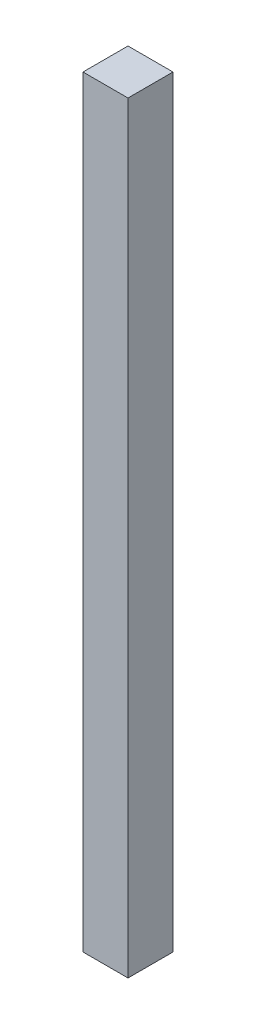
ISO-10303-21;
HEADER;
FILE_DESCRIPTION(('STEP AP214'),'2;1');
FILE_NAME('part.step','',(''),(''),'','','');
FILE_SCHEMA(('AUTOMOTIVE_DESIGN { 1 0 10303 214 1 1 1 1 }'));
ENDSEC;
DATA;
#1=APPLICATION_CONTEXT('core data for automotive mechanical design processes');
#2=APPLICATION_PROTOCOL_DEFINITION('international standard','automotive_design',2000,#1);
#3=PRODUCT_CONTEXT('',#1,'mechanical');
#4=PRODUCT('Part','Part','',(#3));
#5=PRODUCT_RELATED_PRODUCT_CATEGORY('part','',(#4));
#6=PRODUCT_DEFINITION_FORMATION('','',#4);
#7=PRODUCT_DEFINITION_CONTEXT('part definition',#1,'design');
#8=PRODUCT_DEFINITION('design','',#6,#7);
#9=PRODUCT_DEFINITION_SHAPE('','',#8);
#10=(LENGTH_UNIT() NAMED_UNIT(*) SI_UNIT(.MILLI.,.METRE.));
#11=(NAMED_UNIT(*) PLANE_ANGLE_UNIT() SI_UNIT($,.RADIAN.));
#12=(NAMED_UNIT(*) SI_UNIT($,.STERADIAN.) SOLID_ANGLE_UNIT());
#13=UNCERTAINTY_MEASURE_WITH_UNIT(LENGTH_MEASURE(1.E-05),#10,'distance_accuracy_value','');
#14=(GEOMETRIC_REPRESENTATION_CONTEXT(3) GLOBAL_UNCERTAINTY_ASSIGNED_CONTEXT((#13)) GLOBAL_UNIT_ASSIGNED_CONTEXT((#10,
#11,#12)) REPRESENTATION_CONTEXT('',''));
#15=CARTESIAN_POINT('',(0.,0.,0.));
#16=DIRECTION('',(0.,0.,1.));
#17=DIRECTION('',(1.,0.,0.));
#18=AXIS2_PLACEMENT_3D('',#15,#16,#17);
#19=CARTESIAN_POINT('',(-39.8355089835924,430.,-18.6136158048334));
#20=DIRECTION('',(1.,0.,0.));
#21=DIRECTION('',(0.,0.,-1.));
#22=AXIS2_PLACEMENT_3D('',#19,#20,#21);
#23=PLANE('',#22);
#24=DIRECTION('',(0.,0.,1.));
#25=VECTOR('',#24,1.);
#26=CARTESIAN_POINT('',(-39.8355089835924,0.,-18.6136158048334));
#27=LINE('',#26,#25);
#28=CARTESIAN_POINT('',(-39.8355089835924,0.,-18.6136158048334));
#29=VERTEX_POINT('',#28);
#30=CARTESIAN_POINT('',(-39.8355089835924,0.,6.78638419516663));
#31=VERTEX_POINT('',#30);
#32=EDGE_CURVE('E94',#29,#31,#27,.T.);
#33=ORIENTED_EDGE('',*,*,#32,.T.);
#34=DIRECTION('',(0.,-1.,0.));
#35=VECTOR('',#34,1.);
#36=CARTESIAN_POINT('',(-39.8355089835924,430.,6.78638419516663));
#37=LINE('',#36,#35);
#38=CARTESIAN_POINT('',(-39.8355089835924,430.,6.78638419516663));
#39=VERTEX_POINT('',#38);
#40=EDGE_CURVE('E11',#39,#31,#37,.T.);
#41=ORIENTED_EDGE('',*,*,#40,.F.);
#42=DIRECTION('',(0.,0.,1.));
#43=VECTOR('',#42,1.);
#44=CARTESIAN_POINT('',(-39.8355089835924,430.,-18.6136158048334));
#45=LINE('',#44,#43);
#46=CARTESIAN_POINT('',(-39.8355089835924,430.,-18.6136158048334));
#47=VERTEX_POINT('',#46);
#48=EDGE_CURVE('E82',#47,#39,#45,.T.);
#49=ORIENTED_EDGE('',*,*,#48,.F.);
#50=DIRECTION('',(0.,-1.,0.));
#51=VECTOR('',#50,1.);
#52=CARTESIAN_POINT('',(-39.8355089835924,430.,-18.6136158048334));
#53=LINE('',#52,#51);
#54=EDGE_CURVE('E90',#47,#29,#53,.T.);
#55=ORIENTED_EDGE('',*,*,#54,.T.);
#56=EDGE_LOOP('',(#33,#41,#49,#55));
#57=FACE_BOUND('',#56,.T.);
#58=ADVANCED_FACE('F31',(#57),#23,.F.);
#59=CARTESIAN_POINT('',(-39.8355089835924,430.,6.78638419516663));
#60=DIRECTION('',(0.,0.,-1.));
#61=DIRECTION('',(-1.,0.,0.));
#62=AXIS2_PLACEMENT_3D('',#59,#60,#61);
#63=PLANE('',#62);
#64=DIRECTION('',(1.,0.,0.));
#65=VECTOR('',#64,1.);
#66=CARTESIAN_POINT('',(-39.8355089835924,0.,6.78638419516663));
#67=LINE('',#66,#65);
#68=CARTESIAN_POINT('',(-14.4355089835924,0.,6.78638419516663));
#69=VERTEX_POINT('',#68);
#70=EDGE_CURVE('E86',#31,#69,#67,.T.);
#71=ORIENTED_EDGE('',*,*,#70,.T.);
#72=DIRECTION('',(0.,-1.,0.));
#73=VECTOR('',#72,1.);
#74=CARTESIAN_POINT('',(-14.4355089835924,430.,6.78638419516663));
#75=LINE('',#74,#73);
#76=CARTESIAN_POINT('',(-14.4355089835924,430.,6.78638419516663));
#77=VERTEX_POINT('',#76);
#78=EDGE_CURVE('E39',#77,#69,#75,.T.);
#79=ORIENTED_EDGE('',*,*,#78,.F.);
#80=DIRECTION('',(1.,0.,0.));
#81=VECTOR('',#80,1.);
#82=CARTESIAN_POINT('',(-39.8355089835924,430.,6.78638419516663));
#83=LINE('',#82,#81);
#84=EDGE_CURVE('E77',#39,#77,#83,.T.);
#85=ORIENTED_EDGE('',*,*,#84,.F.);
#86=ORIENTED_EDGE('',*,*,#40,.T.);
#87=EDGE_LOOP('',(#71,#79,#85,#86));
#88=FACE_BOUND('',#87,.T.);
#89=ADVANCED_FACE('F85',(#88),#63,.F.);
#90=CARTESIAN_POINT('',(-14.4355089835924,430.,-18.6136158048334));
#91=DIRECTION('',(-1.,0.,0.));
#92=DIRECTION('',(0.,0.,1.));
#93=AXIS2_PLACEMENT_3D('',#90,#91,#92);
#94=PLANE('',#93);
#95=DIRECTION('',(0.,0.,-1.));
#96=VECTOR('',#95,1.);
#97=CARTESIAN_POINT('',(-14.4355089835924,0.,-18.6136158048334));
#98=LINE('',#97,#96);
#99=CARTESIAN_POINT('',(-14.4355089835924,0.,-18.6136158048334));
#100=VERTEX_POINT('',#99);
#101=EDGE_CURVE('E64',#69,#100,#98,.T.);
#102=ORIENTED_EDGE('',*,*,#101,.T.);
#103=DIRECTION('',(0.,-1.,0.));
#104=VECTOR('',#103,1.);
#105=CARTESIAN_POINT('',(-14.4355089835924,430.,-18.6136158048334));
#106=LINE('',#105,#104);
#107=CARTESIAN_POINT('',(-14.4355089835924,430.,-18.6136158048334));
#108=VERTEX_POINT('',#107);
#109=EDGE_CURVE('E87',#108,#100,#106,.T.);
#110=ORIENTED_EDGE('',*,*,#109,.F.);
#111=DIRECTION('',(0.,0.,-1.));
#112=VECTOR('',#111,1.);
#113=CARTESIAN_POINT('',(-14.4355089835924,430.,-18.6136158048334));
#114=LINE('',#113,#112);
#115=EDGE_CURVE('E80',#77,#108,#114,.T.);
#116=ORIENTED_EDGE('',*,*,#115,.F.);
#117=ORIENTED_EDGE('',*,*,#78,.T.);
#118=EDGE_LOOP('',(#102,#110,#116,#117));
#119=FACE_BOUND('',#118,.T.);
#120=ADVANCED_FACE('F88',(#119),#94,.F.);
#121=CARTESIAN_POINT('',(-39.8355089835924,430.,-18.6136158048334));
#122=DIRECTION('',(0.,0.,1.));
#123=DIRECTION('',(1.,0.,0.));
#124=AXIS2_PLACEMENT_3D('',#121,#122,#123);
#125=PLANE('',#124);
#126=DIRECTION('',(-1.,0.,0.));
#127=VECTOR('',#126,1.);
#128=CARTESIAN_POINT('',(-39.8355089835924,0.,-18.6136158048334));
#129=LINE('',#128,#127);
#130=EDGE_CURVE('E70',#100,#29,#129,.T.);
#131=ORIENTED_EDGE('',*,*,#130,.T.);
#132=ORIENTED_EDGE('',*,*,#54,.F.);
#133=DIRECTION('',(-1.,0.,0.));
#134=VECTOR('',#133,1.);
#135=CARTESIAN_POINT('',(-39.8355089835924,430.,-18.6136158048334));
#136=LINE('',#135,#134);
#137=EDGE_CURVE('E47',#108,#47,#136,.T.);
#138=ORIENTED_EDGE('',*,*,#137,.F.);
#139=ORIENTED_EDGE('',*,*,#109,.T.);
#140=EDGE_LOOP('',(#131,#132,#138,#139));
#141=FACE_BOUND('',#140,.T.);
#142=ADVANCED_FACE('F101',(#141),#125,.F.);
#143=CARTESIAN_POINT('',(-39.8355089835924,430.,6.78638419516663));
#144=DIRECTION('',(0.,1.,0.));
#145=DIRECTION('',(0.,0.,1.));
#146=AXIS2_PLACEMENT_3D('',#143,#144,#145);
#147=PLANE('',#146);
#148=ORIENTED_EDGE('',*,*,#48,.T.);
#149=ORIENTED_EDGE('',*,*,#84,.T.);
#150=ORIENTED_EDGE('',*,*,#115,.T.);
#151=ORIENTED_EDGE('',*,*,#137,.T.);
#152=EDGE_LOOP('',(#148,#149,#150,#151));
#153=FACE_BOUND('',#152,.T.);
#154=ADVANCED_FACE('F78',(#153),#147,.T.);
#155=CARTESIAN_POINT('',(-39.8355089835924,0.,6.78638419516663));
#156=DIRECTION('',(0.,1.,0.));
#157=DIRECTION('',(0.,0.,1.));
#158=AXIS2_PLACEMENT_3D('',#155,#156,#157);
#159=PLANE('',#158);
#160=ORIENTED_EDGE('',*,*,#32,.F.);
#161=ORIENTED_EDGE('',*,*,#130,.F.);
#162=ORIENTED_EDGE('',*,*,#101,.F.);
#163=ORIENTED_EDGE('',*,*,#70,.F.);
#164=EDGE_LOOP('',(#160,#161,#162,#163));
#165=FACE_BOUND('',#164,.T.);
#166=ADVANCED_FACE('F104',(#165),#159,.F.);
#167=CLOSED_SHELL('',(#58,#89,#120,#142,#154,#166));
#168=MANIFOLD_SOLID_BREP('B2',#167);
#169=ADVANCED_BREP_SHAPE_REPRESENTATION('',(#18,#168),#14);
#170=SHAPE_DEFINITION_REPRESENTATION(#9,#169);
ENDSEC;
END-ISO-10303-21;
